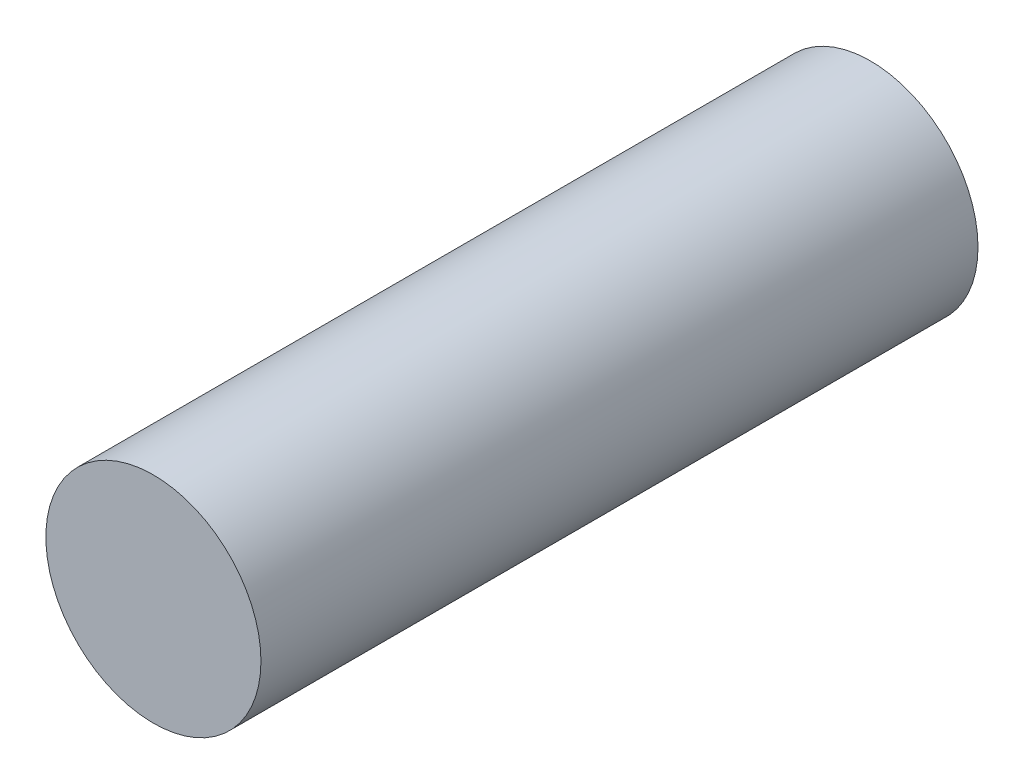
ISO-10303-21;
HEADER;
FILE_DESCRIPTION(('STEP AP214'),'2;1');
FILE_NAME('part.step','',(''),(''),'','','');
FILE_SCHEMA(('AUTOMOTIVE_DESIGN { 1 0 10303 214 1 1 1 1 }'));
ENDSEC;
DATA;
#1=APPLICATION_CONTEXT('core data for automotive mechanical design processes');
#2=APPLICATION_PROTOCOL_DEFINITION('international standard','automotive_design',2000,#1);
#3=PRODUCT_CONTEXT('',#1,'mechanical');
#4=PRODUCT('Part','Part','',(#3));
#5=PRODUCT_RELATED_PRODUCT_CATEGORY('part','',(#4));
#6=PRODUCT_DEFINITION_FORMATION('','',#4);
#7=PRODUCT_DEFINITION_CONTEXT('part definition',#1,'design');
#8=PRODUCT_DEFINITION('design','',#6,#7);
#9=PRODUCT_DEFINITION_SHAPE('','',#8);
#10=(LENGTH_UNIT() NAMED_UNIT(*) SI_UNIT(.MILLI.,.METRE.));
#11=(NAMED_UNIT(*) PLANE_ANGLE_UNIT() SI_UNIT($,.RADIAN.));
#12=(NAMED_UNIT(*) SI_UNIT($,.STERADIAN.) SOLID_ANGLE_UNIT());
#13=UNCERTAINTY_MEASURE_WITH_UNIT(LENGTH_MEASURE(1.E-05),#10,'distance_accuracy_value','');
#14=(GEOMETRIC_REPRESENTATION_CONTEXT(3) GLOBAL_UNCERTAINTY_ASSIGNED_CONTEXT((#13)) GLOBAL_UNIT_ASSIGNED_CONTEXT((#10,
#11,#12)) REPRESENTATION_CONTEXT('',''));
#15=CARTESIAN_POINT('',(0.,0.,0.));
#16=DIRECTION('',(0.,0.,1.));
#17=DIRECTION('',(1.,0.,0.));
#18=AXIS2_PLACEMENT_3D('',#15,#16,#17);
#19=CARTESIAN_POINT('',(0.,0.,1.));
#20=DIRECTION('',(0.,0.,-1.));
#21=DIRECTION('',(-1.,0.,0.));
#22=AXIS2_PLACEMENT_3D('',#19,#20,#21);
#23=CYLINDRICAL_SURFACE('',#22,0.15);
#24=CARTESIAN_POINT('',(0.,0.,1.));
#25=DIRECTION('',(0.,0.,1.));
#26=DIRECTION('',(1.,0.,0.));
#27=AXIS2_PLACEMENT_3D('',#24,#25,#26);
#28=CIRCLE('',#27,0.15);
#29=CARTESIAN_POINT('',(0.15,0.,1.));
#30=VERTEX_POINT('',#29);
#31=EDGE_CURVE('E10',#30,#30,#28,.T.);
#32=ORIENTED_EDGE('',*,*,#31,.F.);
#33=EDGE_LOOP('',(#32));
#34=FACE_BOUND('',#33,.T.);
#35=CARTESIAN_POINT('',(0.,0.,0.));
#36=DIRECTION('',(0.,0.,1.));
#37=DIRECTION('',(1.,0.,0.));
#38=AXIS2_PLACEMENT_3D('',#35,#36,#37);
#39=CIRCLE('',#38,0.15);
#40=CARTESIAN_POINT('',(0.15,0.,0.));
#41=VERTEX_POINT('',#40);
#42=EDGE_CURVE('E44',#41,#41,#39,.T.);
#43=ORIENTED_EDGE('',*,*,#42,.T.);
#44=EDGE_LOOP('',(#43));
#45=FACE_BOUND('',#44,.T.);
#46=ADVANCED_FACE('F41',(#34,#45),#23,.T.);
#47=CARTESIAN_POINT('',(0.,0.,1.));
#48=DIRECTION('',(0.,0.,1.));
#49=DIRECTION('',(1.,0.,0.));
#50=AXIS2_PLACEMENT_3D('',#47,#48,#49);
#51=PLANE('',#50);
#52=ORIENTED_EDGE('',*,*,#31,.T.);
#53=EDGE_LOOP('',(#52));
#54=FACE_BOUND('',#53,.T.);
#55=ADVANCED_FACE('F58',(#54),#51,.T.);
#56=CARTESIAN_POINT('',(0.,0.,0.));
#57=DIRECTION('',(0.,0.,1.));
#58=DIRECTION('',(1.,0.,0.));
#59=AXIS2_PLACEMENT_3D('',#56,#57,#58);
#60=PLANE('',#59);
#61=ORIENTED_EDGE('',*,*,#42,.F.);
#62=EDGE_LOOP('',(#61));
#63=FACE_BOUND('',#62,.T.);
#64=ADVANCED_FACE('F56',(#63),#60,.F.);
#65=CLOSED_SHELL('',(#46,#55,#64));
#66=MANIFOLD_SOLID_BREP('B2',#65);
#67=ADVANCED_BREP_SHAPE_REPRESENTATION('',(#18,#66),#14);
#68=SHAPE_DEFINITION_REPRESENTATION(#9,#67);
ENDSEC;
END-ISO-10303-21;
